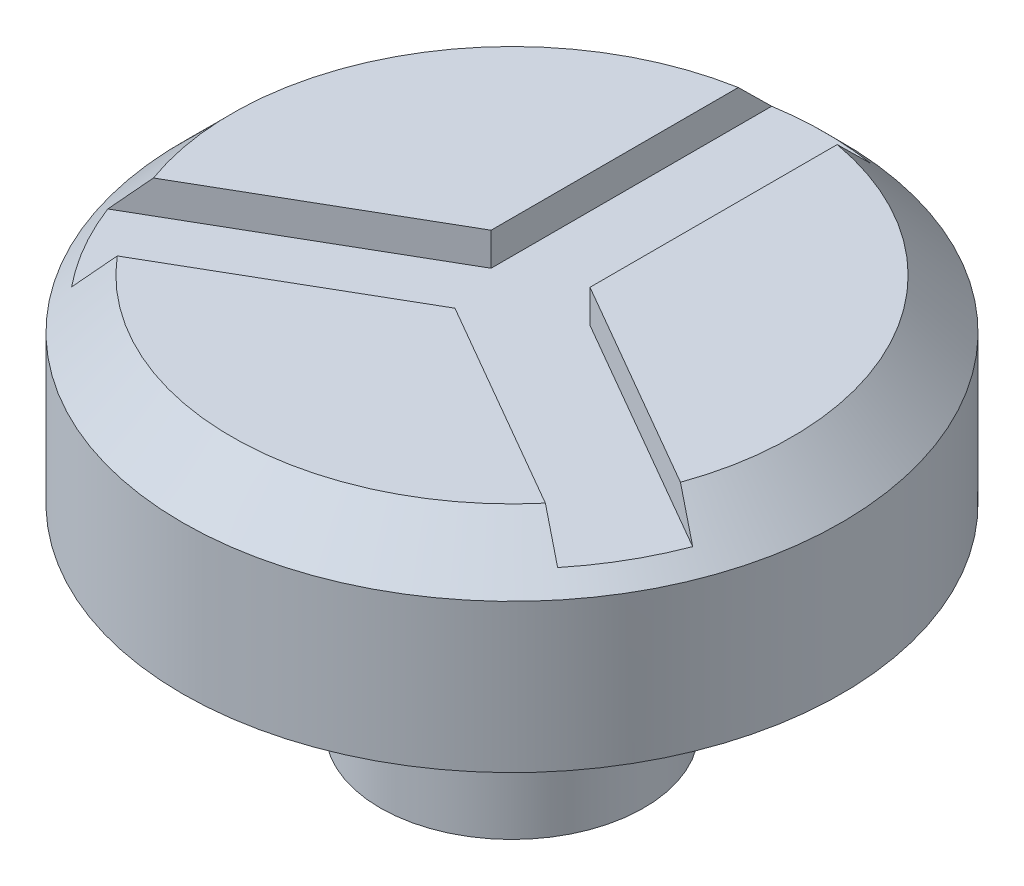
ISO-10303-21;
HEADER;
FILE_DESCRIPTION(('STEP AP214'),'2;1');
FILE_NAME('part.step','',(''),(''),'','','');
FILE_SCHEMA(('AUTOMOTIVE_DESIGN { 1 0 10303 214 1 1 1 1 }'));
ENDSEC;
DATA;
#1=APPLICATION_CONTEXT('core data for automotive mechanical design processes');
#2=APPLICATION_PROTOCOL_DEFINITION('international standard','automotive_design',2000,#1);
#3=PRODUCT_CONTEXT('',#1,'mechanical');
#4=PRODUCT('Part','Part','',(#3));
#5=PRODUCT_RELATED_PRODUCT_CATEGORY('part','',(#4));
#6=PRODUCT_DEFINITION_FORMATION('','',#4);
#7=PRODUCT_DEFINITION_CONTEXT('part definition',#1,'design');
#8=PRODUCT_DEFINITION('design','',#6,#7);
#9=PRODUCT_DEFINITION_SHAPE('','',#8);
#10=(LENGTH_UNIT() NAMED_UNIT(*) SI_UNIT(.MILLI.,.METRE.));
#11=(NAMED_UNIT(*) PLANE_ANGLE_UNIT() SI_UNIT($,.RADIAN.));
#12=(NAMED_UNIT(*) SI_UNIT($,.STERADIAN.) SOLID_ANGLE_UNIT());
#13=UNCERTAINTY_MEASURE_WITH_UNIT(LENGTH_MEASURE(1.E-05),#10,'distance_accuracy_value','');
#14=(GEOMETRIC_REPRESENTATION_CONTEXT(3) GLOBAL_UNCERTAINTY_ASSIGNED_CONTEXT((#13)) GLOBAL_UNIT_ASSIGNED_CONTEXT((#10,
#11,#12)) REPRESENTATION_CONTEXT('',''));
#15=CARTESIAN_POINT('',(0.,0.,0.));
#16=DIRECTION('',(0.,0.,1.));
#17=DIRECTION('',(1.,0.,0.));
#18=AXIS2_PLACEMENT_3D('',#15,#16,#17);
#19=CARTESIAN_POINT('',(0.,60.,0.));
#20=DIRECTION('',(0.,1.,0.));
#21=DIRECTION('',(0.,0.,1.));
#22=AXIS2_PLACEMENT_3D('',#19,#20,#21);
#23=PLANE('',#22);
#24=DIRECTION('',(0.866025403784439,0.,0.5));
#25=VECTOR('',#24,1.);
#26=CARTESIAN_POINT('',(39.5512701892219,60.,31.4951905283833));
#27=LINE('',#26,#25);
#28=CARTESIAN_POINT('',(0.,60.,8.66025403784439));
#29=VERTEX_POINT('',#28);
#30=CARTESIAN_POINT('',(32.4784418654736,60.,27.4116911917352));
#31=VERTEX_POINT('',#30);
#32=EDGE_CURVE('E117',#29,#31,#27,.T.);
#33=ORIENTED_EDGE('',*,*,#32,.F.);
#34=DIRECTION('',(0.866025403784439,0.,-0.5));
#35=VECTOR('',#34,1.);
#36=CARTESIAN_POINT('',(0.,60.,8.66025403784439));
#37=LINE('',#36,#35);
#38=CARTESIAN_POINT('',(-32.4784418654736,60.,27.4116911917352));
#39=VERTEX_POINT('',#38);
#40=EDGE_CURVE('E150',#39,#29,#37,.T.);
#41=ORIENTED_EDGE('',*,*,#40,.F.);
#42=CARTESIAN_POINT('',(0.,60.,0.));
#43=DIRECTION('',(0.,1.,0.));
#44=DIRECTION('',(0.,0.,1.));
#45=AXIS2_PLACEMENT_3D('',#42,#43,#44);
#46=CIRCLE('',#45,42.5);
#47=EDGE_CURVE('E165',#39,#31,#46,.T.);
#48=ORIENTED_EDGE('',*,*,#47,.T.);
#49=EDGE_LOOP('',(#33,#41,#48));
#50=FACE_BOUND('',#49,.T.);
#51=ADVANCED_FACE('F38',(#50),#23,.T.);
#52=DIRECTION('',(-0.866025403784438,0.,0.5));
#53=VECTOR('',#52,1.);
#54=CARTESIAN_POINT('',(-7.5,60.,-4.33012701892219));
#55=LINE('',#54,#53);
#56=CARTESIAN_POINT('',(-7.5,60.,-4.33012701892219));
#57=VERTEX_POINT('',#56);
#58=CARTESIAN_POINT('',(-39.9784418654736,60.,14.4213101349686));
#59=VERTEX_POINT('',#58);
#60=EDGE_CURVE('E148',#57,#59,#55,.T.);
#61=ORIENTED_EDGE('',*,*,#60,.F.);
#62=DIRECTION('',(0.,0.,1.));
#63=VECTOR('',#62,1.);
#64=CARTESIAN_POINT('',(-7.5,60.,-4.33012701892219));
#65=LINE('',#64,#63);
#66=CARTESIAN_POINT('',(-7.5,60.,-41.8330013267038));
#67=VERTEX_POINT('',#66);
#68=EDGE_CURVE('E146',#67,#57,#65,.T.);
#69=ORIENTED_EDGE('',*,*,#68,.F.);
#70=EDGE_CURVE('E170',#67,#59,#46,.T.);
#71=ORIENTED_EDGE('',*,*,#70,.T.);
#72=EDGE_LOOP('',(#61,#69,#71));
#73=FACE_BOUND('',#72,.T.);
#74=ADVANCED_FACE('F236',(#73),#23,.T.);
#75=CARTESIAN_POINT('',(0.,30.,0.));
#76=DIRECTION('',(0.,-1.,0.));
#77=DIRECTION('',(0.,0.,-1.));
#78=AXIS2_PLACEMENT_3D('',#75,#76,#77);
#79=CYLINDRICAL_SURFACE('',#78,20.);
#80=CARTESIAN_POINT('',(0.,30.,0.));
#81=DIRECTION('',(0.,1.,0.));
#82=DIRECTION('',(0.,0.,1.));
#83=AXIS2_PLACEMENT_3D('',#80,#81,#82);
#84=CIRCLE('',#83,20.);
#85=CARTESIAN_POINT('',(0.,30.,20.));
#86=VERTEX_POINT('',#85);
#87=EDGE_CURVE('E162',#86,#86,#84,.T.);
#88=ORIENTED_EDGE('',*,*,#87,.F.);
#89=EDGE_LOOP('',(#88));
#90=FACE_BOUND('',#89,.T.);
#91=CARTESIAN_POINT('',(0.,0.,0.));
#92=DIRECTION('',(0.,1.,0.));
#93=DIRECTION('',(0.,0.,1.));
#94=AXIS2_PLACEMENT_3D('',#91,#92,#93);
#95=CIRCLE('',#94,20.);
#96=CARTESIAN_POINT('',(0.,0.,20.));
#97=VERTEX_POINT('',#96);
#98=EDGE_CURVE('E161',#97,#97,#95,.T.);
#99=ORIENTED_EDGE('',*,*,#98,.T.);
#100=EDGE_LOOP('',(#99));
#101=FACE_BOUND('',#100,.T.);
#102=ADVANCED_FACE('F241',(#90,#101),#79,.T.);
#103=CARTESIAN_POINT('',(0.,0.,0.));
#104=DIRECTION('',(0.,1.,0.));
#105=DIRECTION('',(0.,0.,1.));
#106=AXIS2_PLACEMENT_3D('',#103,#104,#105);
#107=PLANE('',#106);
#108=ORIENTED_EDGE('',*,*,#98,.F.);
#109=EDGE_LOOP('',(#108));
#110=FACE_BOUND('',#109,.T.);
#111=ADVANCED_FACE('F253',(#110),#107,.F.);
#112=CARTESIAN_POINT('',(0.,60.,0.));
#113=DIRECTION('',(0.,-1.,0.));
#114=DIRECTION('',(0.,0.,-1.));
#115=AXIS2_PLACEMENT_3D('',#112,#113,#114);
#116=CYLINDRICAL_SURFACE('',#115,50.);
#117=CARTESIAN_POINT('',(0.,52.5,0.));
#118=DIRECTION('',(0.,1.,0.));
#119=DIRECTION('',(0.,0.,1.));
#120=AXIS2_PLACEMENT_3D('',#117,#118,#119);
#121=CIRCLE('',#120,50.);
#122=CARTESIAN_POINT('',(0.,52.5,50.));
#123=VERTEX_POINT('',#122);
#124=EDGE_CURVE('E172',#123,#123,#121,.F.);
#125=ORIENTED_EDGE('',*,*,#124,.T.);
#126=EDGE_LOOP('',(#125));
#127=FACE_BOUND('',#126,.T.);
#128=CARTESIAN_POINT('',(0.,30.,0.));
#129=DIRECTION('',(0.,1.,0.));
#130=DIRECTION('',(0.,0.,1.));
#131=AXIS2_PLACEMENT_3D('',#128,#129,#130);
#132=CIRCLE('',#131,50.);
#133=CARTESIAN_POINT('',(0.,30.,50.));
#134=VERTEX_POINT('',#133);
#135=EDGE_CURVE('E156',#134,#134,#132,.T.);
#136=ORIENTED_EDGE('',*,*,#135,.T.);
#137=EDGE_LOOP('',(#136));
#138=FACE_BOUND('',#137,.T.);
#139=ADVANCED_FACE('F246',(#127,#138),#116,.T.);
#140=DIRECTION('',(0.,0.,-1.));
#141=VECTOR('',#140,1.);
#142=CARTESIAN_POINT('',(7.5,60.,-4.33012701892221));
#143=LINE('',#142,#141);
#144=CARTESIAN_POINT('',(7.5,60.,-4.33012701892221));
#145=VERTEX_POINT('',#144);
#146=CARTESIAN_POINT('',(7.5,60.,-41.8330013267038));
#147=VERTEX_POINT('',#146);
#148=EDGE_CURVE('E144',#145,#147,#143,.T.);
#149=ORIENTED_EDGE('',*,*,#148,.F.);
#150=DIRECTION('',(-0.866025403784438,0.,-0.5));
#151=VECTOR('',#150,1.);
#152=CARTESIAN_POINT('',(47.0512701892219,60.,18.5048094716167));
#153=LINE('',#152,#151);
#154=CARTESIAN_POINT('',(39.9784418654736,60.,14.4213101349686));
#155=VERTEX_POINT('',#154);
#156=EDGE_CURVE('E123',#155,#145,#153,.T.);
#157=ORIENTED_EDGE('',*,*,#156,.F.);
#158=EDGE_CURVE('E171',#155,#147,#46,.T.);
#159=ORIENTED_EDGE('',*,*,#158,.T.);
#160=EDGE_LOOP('',(#149,#157,#159));
#161=FACE_BOUND('',#160,.T.);
#162=ADVANCED_FACE('F200',(#161),#23,.T.);
#163=CARTESIAN_POINT('',(0.,30.,0.));
#164=DIRECTION('',(0.,1.,0.));
#165=DIRECTION('',(0.,0.,1.));
#166=AXIS2_PLACEMENT_3D('',#163,#164,#165);
#167=PLANE('',#166);
#168=ORIENTED_EDGE('',*,*,#87,.T.);
#169=EDGE_LOOP('',(#168));
#170=FACE_BOUND('',#169,.T.);
#171=ORIENTED_EDGE('',*,*,#135,.F.);
#172=EDGE_LOOP('',(#171));
#173=FACE_BOUND('',#172,.T.);
#174=ADVANCED_FACE('F245',(#170,#173),#167,.F.);
#175=CARTESIAN_POINT('',(0.,60.,0.));
#176=DIRECTION('',(0.,-1.,0.));
#177=DIRECTION('',(0.,0.,-1.));
#178=AXIS2_PLACEMENT_3D('',#175,#176,#177);
#179=CONICAL_SURFACE('',#178,42.5,0.785398163397446);
#180=CARTESIAN_POINT('',(-36.870367428545,54.9998,29.9473705978353));
#181=CARTESIAN_POINT('',(-36.5046308322191,55.4168182899522,29.736212475494));
#182=CARTESIAN_POINT('',(-36.138833818509,55.833765938987,29.5250194711597));
#183=CARTESIAN_POINT('',(-35.4071079359677,56.6675068059703,29.1025573359015));
#184=CARTESIAN_POINT('',(-35.0411790671576,57.0843000239431,28.8912882049897));
#185=CARTESIAN_POINT('',(-34.3091783291183,57.9177190220173,28.4686673818357));
#186=CARTESIAN_POINT('',(-33.9431064598858,58.3343448021145,28.2573156895916));
#187=CARTESIAN_POINT('',(-33.2108065619172,59.1674134672323,27.8345221463719));
#188=CARTESIAN_POINT('',(-32.8445785331564,59.5838563522238,27.6230802953821));
#189=CARTESIAN_POINT('',(-32.4782658987427,60.0002,27.4115895972957));
#190=B_SPLINE_CURVE_WITH_KNOTS('',3,(#180,#181,#182,#183,#184,#185,#186,#187,#188,#189),
.UNSPECIFIED.,.F.,.F.,(4,2,2,2,4),(0.,1.78053289386737,3.56106550523206,5.34159815987409,
7.12213109711299),.UNSPECIFIED.);
#191=CARTESIAN_POINT('',(-36.8701920231798,55.,29.9472693275005));
#192=VERTEX_POINT('',#191);
#193=EDGE_CURVE('E11',#192,#39,#190,.T.);
#194=ORIENTED_EDGE('',*,*,#193,.F.);
#195=CARTESIAN_POINT('',(0.,55.,0.));
#196=DIRECTION('',(0.,-1.,0.));
#197=DIRECTION('',(0.,0.,-1.));
#198=AXIS2_PLACEMENT_3D('',#195,#196,#197);
#199=CIRCLE('',#198,47.5);
#200=CARTESIAN_POINT('',(-44.3701920231798,55.,16.9568882707339));
#201=VERTEX_POINT('',#200);
#202=EDGE_CURVE('E177',#201,#192,#199,.F.);
#203=ORIENTED_EDGE('',*,*,#202,.F.);
#204=CARTESIAN_POINT('',(-39.9782658987427,60.0002,14.4212085405291));
#205=CARTESIAN_POINT('',(-40.3445785331564,59.5838563522238,14.6326992386155));
#206=CARTESIAN_POINT('',(-40.7108065619172,59.1674134672323,14.8441410896053));
#207=CARTESIAN_POINT('',(-41.4431064598858,58.3343448021145,15.266934632825));
#208=CARTESIAN_POINT('',(-41.8091783291183,57.9177190220173,15.4782863250691));
#209=CARTESIAN_POINT('',(-42.5411790671576,57.0843000239431,15.9009071482231));
#210=CARTESIAN_POINT('',(-42.9071079359677,56.6675068059703,16.1121762791349));
#211=CARTESIAN_POINT('',(-43.638833818509,55.8337659389871,16.5346384143931));
#212=CARTESIAN_POINT('',(-44.0046308322191,55.4168182899522,16.7458314187275));
#213=CARTESIAN_POINT('',(-44.370367428545,54.9998,16.9569895410687));
#214=B_SPLINE_CURVE_WITH_KNOTS('',3,(#204,#205,#206,#207,#208,#209,#210,#211,#212,#213),
.UNSPECIFIED.,.F.,.F.,(4,2,2,2,4),(0.,1.7805329372389,3.56106559188092,5.3415982032456,
7.12213109711298),.UNSPECIFIED.);
#215=EDGE_CURVE('E53',#59,#201,#214,.T.);
#216=ORIENTED_EDGE('',*,*,#215,.F.);
#217=ORIENTED_EDGE('',*,*,#70,.F.);
#218=CARTESIAN_POINT('',(-7.5,9.05703889329484,-93.1414890389303));
#219=CARTESIAN_POINT('',(-7.5,10.7090878400604,-91.484089807516));
#220=CARTESIAN_POINT('',(-7.5,12.360997561704,-89.8265517883662));
#221=CARTESIAN_POINT('',(-7.5,15.6644802884674,-86.5111398437975));
#222=CARTESIAN_POINT('',(-7.5,17.3160532935459,-84.8532659183374));
#223=CARTESIAN_POINT('',(-7.5,22.2703314132519,-79.8789005925198));
#224=CARTESIAN_POINT('',(-7.5,25.5724433727972,-76.5618183738528));
#225=CARTESIAN_POINT('',(-7.5,32.1780543710886,-69.9216821214136));
#226=CARTESIAN_POINT('',(-7.5,35.4815508604259,-66.5986255507435));
#227=CARTESIAN_POINT('',(-7.5,40.4340411254297,-61.6114515807588));
#228=CARTESIAN_POINT('',(-7.5,42.0843755934234,-59.9486656157465));
#229=CARTESIAN_POINT('',(-7.5,45.3838895063785,-56.6219512164983));
#230=CARTESIAN_POINT('',(-7.5,47.0330689524824,-54.9580227833955));
#231=CARTESIAN_POINT('',(-7.5,50.2442892433119,-51.7151589625117));
#232=CARTESIAN_POINT('',(-7.5,51.8064060881726,-50.1362988426088));
#233=CARTESIAN_POINT('',(-7.5,54.9288662715011,-46.9768140630575));
#234=CARTESIAN_POINT('',(-7.5,56.489209603496,-45.3961893970106));
#235=CARTESIAN_POINT('',(-7.5,59.607692289525,-42.2323496358492));
#236=CARTESIAN_POINT('',(-7.5,61.1658313204809,-40.649134222224));
#237=CARTESIAN_POINT('',(-7.5,64.2787190225544,-37.4794109460616));
#238=CARTESIAN_POINT('',(-7.5,65.8334677367243,-35.8929031258385));
#239=CARTESIAN_POINT('',(-7.5,68.1613399898357,-33.5100281442165));
#240=CARTESIAN_POINT('',(-7.5,68.9363299059803,-32.7154844263305));
#241=CARTESIAN_POINT('',(-7.5,70.4847610585097,-31.1248892433756));
#242=CARTESIAN_POINT('',(-7.5,71.2582022952609,-30.3288377786634));
#243=CARTESIAN_POINT('',(-7.5,72.8031835829414,-28.7348117120257));
#244=CARTESIAN_POINT('',(-7.5,73.5747235336498,-27.9368370129297));
#245=CARTESIAN_POINT('',(-7.5,75.115316953015,-26.3384938510399));
#246=CARTESIAN_POINT('',(-7.5,75.8843704286595,-25.5381253949854));
#247=CARTESIAN_POINT('',(-7.5,77.4190473704026,-23.93445904577));
#248=CARTESIAN_POINT('',(-7.5,78.1846715872045,-23.131161871383));
#249=CARTESIAN_POINT('',(-7.5,79.7115597982406,-21.5204340429372));
#250=CARTESIAN_POINT('',(-7.5,80.4728238122444,-20.7130034076513));
#251=CARTESIAN_POINT('',(-7.5,81.6101259458165,-19.4976168906666));
#252=CARTESIAN_POINT('',(-7.5,81.9884466006674,-19.0917969223772));
#253=CARTESIAN_POINT('',(-7.5,82.7432550484622,-18.2784566501443));
#254=CARTESIAN_POINT('',(-7.5,83.1197428458497,-17.8709363503274));
#255=CARTESIAN_POINT('',(-7.5,83.8704947798185,-17.0538691008906));
#256=CARTESIAN_POINT('',(-7.5,84.244758967678,-16.644322198408));
#257=CARTESIAN_POINT('',(-7.5,84.9905705279583,-15.8227635390833));
#258=CARTESIAN_POINT('',(-7.5,85.362117919899,-15.4107517999896));
#259=CARTESIAN_POINT('',(-7.5,85.8349979416402,-14.8820338839079));
#260=CARTESIAN_POINT('',(-7.5,85.9378932468824,-14.7667241934549));
#261=CARTESIAN_POINT('',(-7.5,86.1434026361248,-14.535853862792));
#262=CARTESIAN_POINT('',(-7.5,86.2460167193276,-14.4202932218722));
#263=CARTESIAN_POINT('',(-7.5,86.5534103241688,-14.0732111065303));
#264=CARTESIAN_POINT('',(-7.5,86.7577399377314,-13.8412908511239));
#265=CARTESIAN_POINT('',(-7.5,87.1650478364739,-13.3762240929386));
#266=CARTESIAN_POINT('',(-7.5,87.3680259830388,-13.1430774686351));
#267=CARTESIAN_POINT('',(-7.5,87.7723946818131,-12.6754135421518));
#268=CARTESIAN_POINT('',(-7.5,87.9737852347585,-12.4408962406073));
#269=CARTESIAN_POINT('',(-7.5,88.5787195061488,-11.7309070599293));
#270=CARTESIAN_POINT('',(-7.5,88.9794720269339,-11.2530396739754));
#271=CARTESIAN_POINT('',(-7.5,89.5728391008482,-10.5299710781164));
#272=CARTESIAN_POINT('',(-7.5,89.7693112337815,-10.2879332541349));
#273=CARTESIAN_POINT('',(-7.5,90.1591729205265,-9.80138994998288));
#274=CARTESIAN_POINT('',(-7.5,90.3525625288453,-9.55688451357122));
#275=CARTESIAN_POINT('',(-7.5,90.7374307376372,-9.06268648223334));
#276=CARTESIAN_POINT('',(-7.5,90.9288745719554,-8.81296676358345));
#277=CARTESIAN_POINT('',(-7.5,91.3071658307577,-8.31005448116425));
#278=CARTESIAN_POINT('',(-7.5,91.4940131736948,-8.05686185590558));
#279=CARTESIAN_POINT('',(-7.5,91.8622807915208,-7.54602284894775));
#280=CARTESIAN_POINT('',(-7.5,92.0436933240046,-7.28837086829813));
#281=CARTESIAN_POINT('',(-7.5,92.3993900417653,-6.76818708544368));
#282=CARTESIAN_POINT('',(-7.5,92.5736745080766,-6.50565547622));
#283=CARTESIAN_POINT('',(-7.5,92.9117853163963,-5.97702376015611));
#284=CARTESIAN_POINT('',(-7.5,93.0756873934159,-5.71097234845842));
#285=CARTESIAN_POINT('',(-7.5,93.3921549454061,-5.17208179997301));
#286=CARTESIAN_POINT('',(-7.5,93.5447179575317,-4.89924120565222));
#287=CARTESIAN_POINT('',(-7.5,93.8347574403491,-4.34645441633658));
#288=CARTESIAN_POINT('',(-7.5,93.9722705244057,-4.06652760225322));
#289=CARTESIAN_POINT('',(-7.5,94.2281942974371,-3.49815231807943));
#290=CARTESIAN_POINT('',(-7.5,94.3466176808312,-3.20970966319347));
#291=CARTESIAN_POINT('',(-7.5,94.5336425804601,-2.69370248226024));
#292=CARTESIAN_POINT('',(-7.5,94.607391421533,-2.4680142809041));
#293=CARTESIAN_POINT('',(-7.5,94.7379614360794,-2.01171530556356));
#294=CARTESIAN_POINT('',(-7.5,94.7947820735978,-1.78110437597087));
#295=CARTESIAN_POINT('',(-7.5,94.8886767135323,-1.31670707162866));
#296=CARTESIAN_POINT('',(-7.5,94.9258214266588,-1.08293520711588));
#297=CARTESIAN_POINT('',(-7.5,94.9786145719957,-0.612957633748463));
#298=CARTESIAN_POINT('',(-7.5,94.9942651059025,-0.376752165126954));
#299=CARTESIAN_POINT('',(-7.5,95.0031323261497,0.0973148691342635));
#300=CARTESIAN_POINT('',(-7.5,94.996232171712,0.3351786679019));
#301=CARTESIAN_POINT('',(-7.5,94.9601779980952,0.809196700612902));
#302=CARTESIAN_POINT('',(-7.5,94.9310226350808,1.0453508304521));
#303=CARTESIAN_POINT('',(-7.5,94.8520546753208,1.51487122014354));
#304=CARTESIAN_POINT('',(-7.5,94.8021787097267,1.74822664872194));
#305=CARTESIAN_POINT('',(-7.5,94.6842887778491,2.21026940814599));
#306=CARTESIAN_POINT('',(-7.5,94.616272815924,2.43895622240001));
#307=CARTESIAN_POINT('',(-7.5,94.4622266914439,2.89904300636613));
#308=CARTESIAN_POINT('',(-7.5,94.3756493004311,3.13025774401728));
#309=CARTESIAN_POINT('',(-7.5,94.188914092908,3.58715071950333));
#310=CARTESIAN_POINT('',(-7.5,94.0887526347316,3.81282745346526));
#311=CARTESIAN_POINT('',(-7.5,93.8772108020739,4.2592479762557));
#312=CARTESIAN_POINT('',(-7.5,93.7658132725064,4.47998357352414));
#313=CARTESIAN_POINT('',(-7.5,93.5340156520235,4.91661453978911));
#314=CARTESIAN_POINT('',(-7.5,93.4136165712933,5.13251044838813));
#315=CARTESIAN_POINT('',(-7.5,93.1644998529775,5.56168406370459));
#316=CARTESIAN_POINT('',(-7.5,93.0357246231391,5.77492818304063));
#317=CARTESIAN_POINT('',(-7.5,92.7720572064322,6.1975919487337));
#318=CARTESIAN_POINT('',(-7.5,92.6371648907728,6.4070115144371));
#319=CARTESIAN_POINT('',(-7.5,92.3624606943627,6.82231109726643));
#320=CARTESIAN_POINT('',(-7.5,92.22265346641,7.02819420122857));
#321=CARTESIAN_POINT('',(-7.5,91.9388516339457,7.43703547909));
#322=CARTESIAN_POINT('',(-7.5,91.7948571803927,7.63999375804201));
#323=CARTESIAN_POINT('',(-7.5,91.4901949029783,8.06157060419899));
#324=CARTESIAN_POINT('',(-7.5,91.3291953103897,8.27994904641512));
#325=CARTESIAN_POINT('',(-7.5,91.0037047111592,8.71409171589388));
#326=CARTESIAN_POINT('',(-7.5,90.8392136034221,8.92985586717598));
#327=CARTESIAN_POINT('',(-7.5,90.3413220103131,9.57381147898465));
#328=CARTESIAN_POINT('',(-7.5,90.0035399369785,9.99861588927034));
#329=CARTESIAN_POINT('',(-7.5,89.3193675919917,10.841563513772));
#330=CARTESIAN_POINT('',(-7.5,88.9729728875094,11.259703108066));
#331=CARTESIAN_POINT('',(-7.5,88.273873346752,12.0906190299451));
#332=CARTESIAN_POINT('',(-7.5,87.9211689028694,12.5033956883055));
#333=CARTESIAN_POINT('',(-7.5,87.2102790413543,13.3254719186727));
#334=CARTESIAN_POINT('',(-7.5,86.8520850193451,13.7347640336635));
#335=CARTESIAN_POINT('',(-7.5,86.131877163166,14.5499788064445));
#336=CARTESIAN_POINT('',(-7.5,85.7698632781008,14.955901419211));
#337=CARTESIAN_POINT('',(-7.5,85.0429032560785,15.7648884821464));
#338=CARTESIAN_POINT('',(-7.5,84.677958035504,16.167953756655));
#339=CARTESIAN_POINT('',(-7.5,83.9455982387959,16.9718358945889));
#340=CARTESIAN_POINT('',(-7.5,83.5781836515706,17.3726527479));
#341=CARTESIAN_POINT('',(-7.5,82.4752551342874,18.5697872827271));
#342=CARTESIAN_POINT('',(-7.5,81.7367473894974,19.363346337507));
#343=CARTESIAN_POINT('',(-7.5,80.2541118098814,20.9452903594623));
#344=CARTESIAN_POINT('',(-7.5,79.5099835784055,21.7336749539865));
#345=CARTESIAN_POINT('',(-7.5,78.0183557981941,23.3058472730174));
#346=CARTESIAN_POINT('',(-7.5,77.2708600472197,24.0896386031214));
#347=CARTESIAN_POINT('',(-7.5,75.7728171200119,25.6543005483303));
#348=CARTESIAN_POINT('',(-7.5,75.0222699371124,26.4351711570476));
#349=CARTESIAN_POINT('',(-7.5,73.1070623719647,28.4217887645941));
#350=CARTESIAN_POINT('',(-7.5,71.9407713546204,29.6259632732646));
#351=CARTESIAN_POINT('',(-7.5,69.6040000625976,32.0308776629351));
#352=CARTESIAN_POINT('',(-7.5,68.4335187283955,33.2316165133332));
#353=CARTESIAN_POINT('',(-7.5,66.0896641514436,35.6304321882914));
#354=CARTESIAN_POINT('',(-7.5,64.9162907116095,36.8285088202256));
#355=CARTESIAN_POINT('',(-7.5,63.1548213778313,38.6239094546137));
#356=CARTESIAN_POINT('',(-7.5,62.5675129253057,39.2220064591844));
#357=CARTESIAN_POINT('',(-7.5,61.3924342912162,40.4177458957106));
#358=CARTESIAN_POINT('',(-7.5,60.8046641099817,41.0153883279896));
#359=CARTESIAN_POINT('',(-7.5,60.2166940647098,41.612834087783));
#360=B_SPLINE_CURVE_WITH_KNOTS('',3,(#218,#219,#220,#221,#222,#223,#224,#225,#226,#227,#228,
#229,#230,#231,#232,#233,#234,#235,#236,#237,#238,#239,#240,#241,#242,#243,#244,#245,#246,#247,
#248,#249,#250,#251,#252,#253,#254,#255,#256,#257,#258,#259,#260,#261,#262,#263,#264,#265,#266,
#267,#268,#269,#270,#271,#272,#273,#274,#275,#276,#277,#278,#279,#280,#281,#282,#283,#284,#285,
#286,#287,#288,#289,#290,#291,#292,#293,#294,#295,#296,#297,#298,#299,#300,#301,#302,#303,#304,
#305,#306,#307,#308,#309,#310,#311,#312,#313,#314,#315,#316,#317,#318,#319,#320,#321,#322,#323,
#324,#325,#326,#327,#328,#329,#330,#331,#332,#333,#334,#335,#336,#337,#338,#339,#340,#341,#342,
#343,#344,#345,#346,#347,#348,#349,#350,#351,#352,#353,#354,#355,#356,#357,#358,#359),
.UNSPECIFIED.,.F.,.F.,(4,2,2,2,2,2,2,2,2,2,2,2,2,2,2,2,2,2,2,2,2,2,2,2,2,2,2,2,2,2,2,2,2,2,2,2,
2,2,2,2,2,2,2,2,2,2,2,2,2,2,2,2,2,2,2,2,2,2,2,2,2,2,2,2,2,2,2,2,2,2,4),(0.,7.02040892053811,
14.040818702249,28.0822852493172,42.1393862430573,49.167625244375,56.195857284878,
62.85896928291,69.5221055220285,76.1861339292965,82.850077214308,86.1798176323004,
89.5095572625578,92.8394688087612,96.1693709888702,99.4985046021966,102.827623109007,
104.492054812404,106.156482478726,107.820871612033,109.485248775079,109.948879659084,
110.412511856311,111.339781933743,112.267145696358,113.194509029081,115.065380351727,
116.00059001042,116.935783113765,117.879718856154,118.823671332974,119.768910129552,
120.714111622726,121.651350279118,122.588791912436,123.5238997229,124.45838310965,
125.170132490005,125.881904402296,126.591100712902,127.300227673502,128.013034612159,
128.725884595615,129.440930893212,130.156055887912,130.896213008812,131.63656894741,
132.37807287235,133.119493707704,133.866701377667,134.613924786876,135.36045892514,
136.106966182516,136.920858464772,137.734774345145,139.362792577141,140.991666825977,
142.620440127505,144.252099452672,145.883780545271,147.514969996377,149.146166779291,
152.398224141933,155.650513194531,158.899764741621,162.149023390588,167.178168167818,
172.208689836619,177.239564353767,179.754293032304,182.269019919064),.UNSPECIFIED.);
#361=CARTESIAN_POINT('',(-7.5,55.,-46.9041575982343));
#362=VERTEX_POINT('',#361);
#363=EDGE_CURVE('E184',#362,#67,#360,.T.);
#364=ORIENTED_EDGE('',*,*,#363,.F.);
#365=CARTESIAN_POINT('',(7.5,55.,-46.9041575982343));
#366=VERTEX_POINT('',#365);
#367=EDGE_CURVE('E175',#366,#362,#199,.F.);
#368=ORIENTED_EDGE('',*,*,#367,.F.);
#369=CARTESIAN_POINT('',(7.5,60.2166940647098,41.6128340877829));
#370=CARTESIAN_POINT('',(7.5,61.3202289826668,40.4914626476753));
#371=CARTESIAN_POINT('',(7.5,62.4231054913646,39.3694418316446));
#372=CARTESIAN_POINT('',(7.5,64.6281874956441,37.1223938606089));
#373=CARTESIAN_POINT('',(7.5,65.7303910249194,35.9973647763203));
#374=CARTESIAN_POINT('',(7.5,67.9531629199132,33.723761835256));
#375=CARTESIAN_POINT('',(7.5,69.0736860509752,32.5751437238751));
#376=CARTESIAN_POINT('',(7.5,70.7513490828612,30.8503568612848));
#377=CARTESIAN_POINT('',(7.5,71.3097566464947,30.2754211376345));
#378=CARTESIAN_POINT('',(7.5,72.4255569481184,29.1245940168272));
#379=CARTESIAN_POINT('',(7.5,72.9829497115447,28.5487026443349));
#380=CARTESIAN_POINT('',(7.5,74.4314457804574,27.0490495877649));
#381=CARTESIAN_POINT('',(7.5,75.3216212712169,26.1243911850925));
#382=CARTESIAN_POINT('',(7.5,77.0979791033843,24.2710294883035));
#383=CARTESIAN_POINT('',(7.5,77.984160955741,23.3423257247924));
#384=CARTESIAN_POINT('',(7.5,79.3108533219179,21.9432983310393));
#385=CARTESIAN_POINT('',(7.5,79.7535281484247,21.4750272409879));
#386=CARTESIAN_POINT('',(7.5,80.6371087890654,20.5368195744372));
#387=CARTESIAN_POINT('',(7.5,81.0780146060877,20.0668830006597));
#388=CARTESIAN_POINT('',(7.5,81.9574759619351,19.1252086999671));
#389=CARTESIAN_POINT('',(7.5,82.3960324652029,18.6534718742976));
#390=CARTESIAN_POINT('',(7.5,83.2704808194082,17.7075398991587));
#391=CARTESIAN_POINT('',(7.5,83.7063726917613,17.2333447695034));
#392=CARTESIAN_POINT('',(7.5,84.5677731647959,16.2896081413359));
#393=CARTESIAN_POINT('',(7.5,84.9933355507699,15.8201157826205));
#394=CARTESIAN_POINT('',(7.5,85.8403446233964,14.8773989448866));
#395=CARTESIAN_POINT('',(7.5,86.2617911736304,14.404174343097));
#396=CARTESIAN_POINT('',(7.5,87.1000473684991,13.4521222646779));
#397=CARTESIAN_POINT('',(7.5,87.5168473469034,12.9732862651094));
#398=CARTESIAN_POINT('',(7.5,88.3431920218447,12.0094538878227));
#399=CARTESIAN_POINT('',(7.5,88.7527374818088,11.5244581676552));
#400=CARTESIAN_POINT('',(7.5,89.3579874977108,10.7926341913849));
#401=CARTESIAN_POINT('',(7.5,89.5574671957157,10.5489278699499));
#402=CARTESIAN_POINT('',(7.5,89.953474657594,10.0591308742485));
#403=CARTESIAN_POINT('',(7.5,90.1500024675974,9.81304023734167));
#404=CARTESIAN_POINT('',(7.5,90.5396173041307,9.31794475705431));
#405=CARTESIAN_POINT('',(7.5,90.7327025473644,9.06893850799613));
#406=CARTESIAN_POINT('',(7.5,91.1145646199565,8.56764385995296));
#407=CARTESIAN_POINT('',(7.5,91.303341529165,8.31535552193399));
#408=CARTESIAN_POINT('',(7.5,91.6750261486833,7.80768049312949));
#409=CARTESIAN_POINT('',(7.5,91.8579502206827,7.55230581319847));
#410=CARTESIAN_POINT('',(7.5,92.2172701079506,7.03695065517956));
#411=CARTESIAN_POINT('',(7.5,92.3936653314173,6.77696976270849));
#412=CARTESIAN_POINT('',(7.5,92.7380353367701,6.25181829844186));
#413=CARTESIAN_POINT('',(7.5,92.9060178146006,5.9866527901745));
#414=CARTESIAN_POINT('',(7.5,93.2314301059831,5.44994945620298));
#415=CARTESIAN_POINT('',(7.5,93.3888627889461,5.17841339056019));
#416=CARTESIAN_POINT('',(7.5,93.5725967476185,4.84263166855545));
#417=CARTESIAN_POINT('',(7.5,93.6053908157369,4.78191651231214));
#418=CARTESIAN_POINT('',(7.5,93.6702811656464,4.66010677271602));
#419=CARTESIAN_POINT('',(7.5,93.7023773811288,4.59901215401031));
#420=CARTESIAN_POINT('',(7.5,93.7975661163665,4.41512841909678));
#421=CARTESIAN_POINT('',(7.5,93.8595470360312,4.29176072557005));
#422=CARTESIAN_POINT('',(7.5,93.980180522622,4.04340275580427));
#423=CARTESIAN_POINT('',(7.5,94.0388330178623,3.91841244468939));
#424=CARTESIAN_POINT('',(7.5,94.1524006302357,3.6667458454068));
#425=CARTESIAN_POINT('',(7.5,94.2073158573323,3.5400696069762));
#426=CARTESIAN_POINT('',(7.5,94.3123866327014,3.28636487345637));
#427=CARTESIAN_POINT('',(7.5,94.3625875144209,3.15935524864488));
#428=CARTESIAN_POINT('',(7.5,94.4584197862695,2.90363120730181));
#429=CARTESIAN_POINT('',(7.5,94.5040511497123,2.77491678081896));
#430=CARTESIAN_POINT('',(7.5,94.63334055293,2.38620759268617));
#431=CARTESIAN_POINT('',(7.5,94.709413485339,2.12360052883843));
#432=CARTESIAN_POINT('',(7.5,94.8250785397794,1.64260484189605));
#433=CARTESIAN_POINT('',(7.5,94.8688453856245,1.42522003946283));
#434=CARTESIAN_POINT('',(7.5,94.9383372938579,0.987599509214975));
#435=CARTESIAN_POINT('',(7.5,94.9640678567622,0.767364671460103));
#436=CARTESIAN_POINT('',(7.5,94.9961574679919,0.325714637411883));
#437=CARTESIAN_POINT('',(7.5,95.0025379094948,0.104301015973269));
#438=CARTESIAN_POINT('',(7.5,94.9956379698784,-0.338238929330965));
#439=CARTESIAN_POINT('',(7.5,94.9823555417034,-0.559365220884488));
#440=CARTESIAN_POINT('',(7.5,94.9369457391795,-0.998670245141997));
#441=CARTESIAN_POINT('',(7.5,94.9049006515519,-1.21685761869508));
#442=CARTESIAN_POINT('',(7.5,94.8235919902349,-1.65001123320929));
#443=CARTESIAN_POINT('',(7.5,94.7743241473488,-1.86497666171991));
#444=CARTESIAN_POINT('',(7.5,94.6604951015589,-2.29132604775903));
#445=CARTESIAN_POINT('',(7.5,94.5958974617625,-2.50270016646644));
#446=CARTESIAN_POINT('',(7.5,94.4536775212337,-2.92095710929444));
#447=CARTESIAN_POINT('',(7.5,94.3760558960399,-3.12784016573277));
#448=CARTESIAN_POINT('',(7.5,94.1711905355033,-3.63239158980473));
#449=CARTESIAN_POINT('',(7.5,94.0376649860865,-3.92750254232703));
#450=CARTESIAN_POINT('',(7.5,93.7526269252929,-4.50896902762197));
#451=CARTESIAN_POINT('',(7.5,93.6011039243954,-4.79531933092419));
#452=CARTESIAN_POINT('',(7.5,93.2840113570685,-5.36091267428773));
#453=CARTESIAN_POINT('',(7.5,93.1184112682306,-5.64013847120724));
#454=CARTESIAN_POINT('',(7.5,92.776666907232,-6.19193818242143));
#455=CARTESIAN_POINT('',(7.5,92.6005247122481,-6.46451339232076));
#456=CARTESIAN_POINT('',(7.5,92.2384301014856,-7.00648307116606));
#457=CARTESIAN_POINT('',(7.5,92.0524055980609,-7.27582915307815));
#458=CARTESIAN_POINT('',(7.5,91.6737384105168,-7.80982458654871));
#459=CARTESIAN_POINT('',(7.5,91.4810954846818,-8.07447376603223));
#460=CARTESIAN_POINT('',(7.5,91.0907894039649,-8.59946840511234));
#461=CARTESIAN_POINT('',(7.5,90.8931335352389,-8.85981929428955));
#462=CARTESIAN_POINT('',(7.5,90.5934439538047,-9.24785406871026));
#463=CARTESIAN_POINT('',(7.5,90.4930144559512,-9.37678207467989));
#464=CARTESIAN_POINT('',(7.5,90.2911834088726,-9.63387475380262));
#465=CARTESIAN_POINT('',(7.5,90.1897818613988,-9.76203942833017));
#466=CARTESIAN_POINT('',(7.5,89.8542125339515,-10.1831924853065));
#467=CARTESIAN_POINT('',(7.5,89.618168974167,-10.4746876233755));
#468=CARTESIAN_POINT('',(7.5,89.1423419182259,-11.054613076549));
#469=CARTESIAN_POINT('',(7.5,88.9025583282651,-11.3430433144762));
#470=CARTESIAN_POINT('',(7.5,88.4199067120421,-11.9173509523059));
#471=CARTESIAN_POINT('',(7.5,88.1770384246553,-12.2032281325521));
#472=CARTESIAN_POINT('',(7.5,87.6887547731115,-12.7728004948077));
#473=CARTESIAN_POINT('',(7.5,87.4433393857766,-13.0564956569204));
#474=CARTESIAN_POINT('',(7.5,86.7037599349311,-13.9049773809585));
#475=CARTESIAN_POINT('',(7.5,86.2064094545121,-14.4669864845776));
#476=CARTESIAN_POINT('',(7.5,85.205590166596,-15.5855303727394));
#477=CARTESIAN_POINT('',(7.5,84.7021212514015,-16.1420650606079));
#478=CARTESIAN_POINT('',(7.5,83.9431338527852,-16.9741018611682));
#479=CARTESIAN_POINT('',(7.5,83.6893334930706,-17.2511740718827));
#480=CARTESIAN_POINT('',(7.5,83.1807255442172,-17.8043875099819));
#481=CARTESIAN_POINT('',(7.5,82.9259179649207,-18.0805287464151));
#482=CARTESIAN_POINT('',(7.5,82.1601656047566,-18.9077354976268));
#483=CARTESIAN_POINT('',(7.5,81.647898011459,-19.4575766029174));
#484=CARTESIAN_POINT('',(7.5,80.6207124788964,-20.5545671717888));
#485=CARTESIAN_POINT('',(7.5,80.1057950931624,-21.1017171542751));
#486=CARTESIAN_POINT('',(7.5,79.0737565983723,-22.1939348582398));
#487=CARTESIAN_POINT('',(7.5,78.5566354869758,-22.7390025775055));
#488=CARTESIAN_POINT('',(7.5,77.0094101437784,-24.3645386039141));
#489=CARTESIAN_POINT('',(7.5,75.9766958408478,-25.4425221141762));
#490=CARTESIAN_POINT('',(7.5,73.9064514499027,-27.593950737489));
#491=CARTESIAN_POINT('',(7.5,72.8689211248763,-28.6673956221032));
#492=CARTESIAN_POINT('',(7.5,70.7911696355628,-30.8102007114659));
#493=CARTESIAN_POINT('',(7.5,69.7509509001534,-31.8795632723601));
#494=CARTESIAN_POINT('',(7.5,67.6679952577836,-34.0157995266236));
#495=CARTESIAN_POINT('',(7.5,66.6252583899682,-35.0826732581818));
#496=CARTESIAN_POINT('',(7.5,64.4164087747866,-37.3385641934274));
#497=CARTESIAN_POINT('',(7.5,63.2500584711633,-38.5273487360472));
#498=CARTESIAN_POINT('',(7.5,60.9155375601159,-40.9031294507196));
#499=CARTESIAN_POINT('',(7.5,59.747366952002,-42.090125622094));
#500=CARTESIAN_POINT('',(7.5,57.4096059198458,-44.4627334587032));
#501=CARTESIAN_POINT('',(7.5,56.240015486927,-45.6483451151902));
#502=CARTESIAN_POINT('',(7.5,53.8997144435846,-48.0184624404016));
#503=CARTESIAN_POINT('',(7.5,52.7290038330289,-49.2029681089957));
#504=CARTESIAN_POINT('',(7.5,49.2148409156316,-52.7558585958125));
#505=CARTESIAN_POINT('',(7.5,46.8700476701475,-55.1229170330317));
#506=CARTESIAN_POINT('',(7.5,42.1780650097651,-59.8546467483155));
#507=CARTESIAN_POINT('',(7.5,39.8308756000782,-62.2193180315498));
#508=CARTESIAN_POINT('',(7.5,35.1160831402023,-66.9657954495127));
#509=CARTESIAN_POINT('',(7.5,32.7484664300241,-69.3475880141396));
#510=CARTESIAN_POINT('',(7.5,28.011961307034,-74.1099116385323));
#511=CARTESIAN_POINT('',(7.5,25.6430728932942,-76.4904426973753));
#512=CARTESIAN_POINT('',(7.5,20.9050792269035,-81.2498124577699));
#513=CARTESIAN_POINT('',(7.5,18.5359742717591,-83.6286514555153));
#514=CARTESIAN_POINT('',(7.5,13.7970166715984,-88.385580561981));
#515=CARTESIAN_POINT('',(7.5,11.4271640272221,-90.7636706713389));
#516=CARTESIAN_POINT('',(7.5,9.05703889329486,-93.1414890389303));
#517=B_SPLINE_CURVE_WITH_KNOTS('',3,(#369,#370,#371,#372,#373,#374,#375,#376,#377,#378,#379,
#380,#381,#382,#383,#384,#385,#386,#387,#388,#389,#390,#391,#392,#393,#394,#395,#396,#397,#398,
#399,#400,#401,#402,#403,#404,#405,#406,#407,#408,#409,#410,#411,#412,#413,#414,#415,#416,#417,
#418,#419,#420,#421,#422,#423,#424,#425,#426,#427,#428,#429,#430,#431,#432,#433,#434,#435,#436,
#437,#438,#439,#440,#441,#442,#443,#444,#445,#446,#447,#448,#449,#450,#451,#452,#453,#454,#455,
#456,#457,#458,#459,#460,#461,#462,#463,#464,#465,#466,#467,#468,#469,#470,#471,#472,#473,#474,
#475,#476,#477,#478,#479,#480,#481,#482,#483,#484,#485,#486,#487,#488,#489,#490,#491,#492,#493,
#494,#495,#496,#497,#498,#499,#500,#501,#502,#503,#504,#505,#506,#507,#508,#509,#510,#511,#512,
#513,#514,#515,#516),.UNSPECIFIED.,.F.,.F.,(4,2,2,2,2,2,2,2,2,2,2,2,2,2,2,2,2,2,2,2,2,2,2,2,2,2,
2,2,2,2,2,2,2,2,2,2,2,2,2,2,2,2,2,2,2,2,2,2,2,2,2,2,2,2,2,2,2,2,2,2,2,2,2,2,2,2,2,2,2,2,2,2,2,
4),(0.,4.7198919581719,9.44481180016132,14.2587503316519,16.66318915625,19.0675668600844,
22.9180974425177,26.7690873924609,28.7022546497333,30.6354187492202,32.5677167816407,
34.4999992637373,36.4009641878192,38.3019919065988,40.2064273553737,42.1106611863236,
43.0554524328785,44.0002288994905,44.9454813309538,45.8907162290055,46.8330246562614,
47.7754182901048,48.7169334600494,49.6581915015564,49.8652052790157,50.0722386413605,
50.4863782409699,50.9005267567023,51.3146630814648,51.7242879442254,52.1339151991024,
52.9530190040794,53.6176025591379,54.2819833482064,54.9456293404847,55.6093444282673,
56.270170259715,56.9311600137276,57.5937368723815,58.2562793745897,59.2271601510066,
60.1986095920166,61.1722218835255,62.1456429656976,63.127543049715,64.1094790325128,
65.0900614699627,65.5803399487039,66.070617544386,67.1958180705763,68.3210468636016,
69.4463715524372,70.5717064904389,72.8230586911006,75.0744505778454,76.2016807316222,
77.3288998975678,79.5833685120918,81.8373838874039,84.0914016572115,88.569872665985,
93.048566462337,97.5240853751257,101.999535157113,106.995754626311,111.991975989545,
116.988228751426,121.984482102446,131.979937527589,141.975371259487,152.050433976232,
162.125504052759,172.197435133624,182.26935761689),.UNSPECIFIED.);
#518=EDGE_CURVE('E131',#147,#366,#517,.T.);
#519=ORIENTED_EDGE('',*,*,#518,.F.);
#520=ORIENTED_EDGE('',*,*,#158,.F.);
#521=CARTESIAN_POINT('',(44.370367428545,54.9998,16.9569895410687));
#522=CARTESIAN_POINT('',(44.0046308322192,55.4168182899522,16.7458314187274));
#523=CARTESIAN_POINT('',(43.638833818509,55.833765938987,16.5346384143931));
#524=CARTESIAN_POINT('',(42.9071079359677,56.6675068059703,16.1121762791349));
#525=CARTESIAN_POINT('',(42.5411790671576,57.0843000239431,15.9009071482231));
#526=CARTESIAN_POINT('',(41.8091783291183,57.9177190220173,15.4782863250691));
#527=CARTESIAN_POINT('',(41.4431064598858,58.3343448021145,15.266934632825));
#528=CARTESIAN_POINT('',(40.7108065619172,59.1674134672323,14.8441410896053));
#529=CARTESIAN_POINT('',(40.3445785331564,59.5838563522238,14.6326992386155));
#530=CARTESIAN_POINT('',(39.9782658987427,60.0002,14.4212085405291));
#531=B_SPLINE_CURVE_WITH_KNOTS('',3,(#521,#522,#523,#524,#525,#526,#527,#528,#529,#530),
.UNSPECIFIED.,.F.,.F.,(4,2,2,2,4),(0.,1.78053289386737,3.56106550523206,5.34159815987409,
7.12213109711299),.UNSPECIFIED.);
#532=CARTESIAN_POINT('',(44.3701920231798,55.,16.9568882707339));
#533=VERTEX_POINT('',#532);
#534=EDGE_CURVE('E202',#533,#155,#531,.T.);
#535=ORIENTED_EDGE('',*,*,#534,.F.);
#536=CARTESIAN_POINT('',(36.8701920231798,55.,29.9472693275005));
#537=VERTEX_POINT('',#536);
#538=EDGE_CURVE('E66',#537,#533,#199,.F.);
#539=ORIENTED_EDGE('',*,*,#538,.F.);
#540=CARTESIAN_POINT('',(32.4782658987427,60.0002,27.4115895972957));
#541=CARTESIAN_POINT('',(32.8445785331564,59.5838563522238,27.623080295382));
#542=CARTESIAN_POINT('',(33.2108065619172,59.1674134672323,27.8345221463719));
#543=CARTESIAN_POINT('',(33.9431064598858,58.3343448021145,28.2573156895916));
#544=CARTESIAN_POINT('',(34.3091783291183,57.9177190220173,28.4686673818357));
#545=CARTESIAN_POINT('',(35.0411790671576,57.0843000239431,28.8912882049897));
#546=CARTESIAN_POINT('',(35.4071079359677,56.6675068059703,29.1025573359015));
#547=CARTESIAN_POINT('',(36.138833818509,55.8337659389871,29.5250194711597));
#548=CARTESIAN_POINT('',(36.5046308322192,55.4168182899522,29.736212475494));
#549=CARTESIAN_POINT('',(36.870367428545,54.9998,29.9473705978353));
#550=B_SPLINE_CURVE_WITH_KNOTS('',3,(#540,#541,#542,#543,#544,#545,#546,#547,#548,#549),
.UNSPECIFIED.,.F.,.F.,(4,2,2,2,4),(0.,1.78053293723891,3.56106559188093,5.34159820324562,
7.122131097113),.UNSPECIFIED.);
#551=EDGE_CURVE('E208',#31,#537,#550,.T.);
#552=ORIENTED_EDGE('',*,*,#551,.F.);
#553=ORIENTED_EDGE('',*,*,#47,.F.);
#554=EDGE_LOOP('',(#194,#203,#216,#217,#364,#368,#519,#520,#535,#539,#552,#553));
#555=FACE_BOUND('',#554,.T.);
#556=ORIENTED_EDGE('',*,*,#124,.F.);
#557=EDGE_LOOP('',(#556));
#558=FACE_BOUND('',#557,.T.);
#559=ADVANCED_FACE('F41',(#555,#558),#179,.T.);
#560=CARTESIAN_POINT('',(39.5512701892219,55.,31.4951905283833));
#561=DIRECTION('',(-0.5,0.,0.866025403784439));
#562=DIRECTION('',(0.866025403784439,0.,0.5));
#563=AXIS2_PLACEMENT_3D('',#560,#561,#562);
#564=PLANE('',#563);
#565=ORIENTED_EDGE('',*,*,#551,.T.);
#566=DIRECTION('',(0.866025403784439,0.,0.5));
#567=VECTOR('',#566,1.);
#568=CARTESIAN_POINT('',(39.5512701892219,55.,31.4951905283833));
#569=LINE('',#568,#567);
#570=CARTESIAN_POINT('',(0.,55.,8.66025403784439));
#571=VERTEX_POINT('',#570);
#572=EDGE_CURVE('E127',#571,#537,#569,.T.);
#573=ORIENTED_EDGE('',*,*,#572,.F.);
#574=DIRECTION('',(0.,1.,0.));
#575=VECTOR('',#574,1.);
#576=CARTESIAN_POINT('',(0.,55.,8.66025403784439));
#577=LINE('',#576,#575);
#578=EDGE_CURVE('E153',#571,#29,#577,.T.);
#579=ORIENTED_EDGE('',*,*,#578,.T.);
#580=ORIENTED_EDGE('',*,*,#32,.T.);
#581=EDGE_LOOP('',(#565,#573,#579,#580));
#582=FACE_BOUND('',#581,.T.);
#583=ADVANCED_FACE('F218',(#582),#564,.F.);
#584=CARTESIAN_POINT('',(0.,55.,8.66025403784439));
#585=DIRECTION('',(0.5,0.,0.866025403784439));
#586=DIRECTION('',(0.866025403784439,0.,-0.5));
#587=AXIS2_PLACEMENT_3D('',#584,#585,#586);
#588=PLANE('',#587);
#589=ORIENTED_EDGE('',*,*,#193,.T.);
#590=ORIENTED_EDGE('',*,*,#40,.T.);
#591=ORIENTED_EDGE('',*,*,#578,.F.);
#592=DIRECTION('',(0.866025403784439,0.,-0.5));
#593=VECTOR('',#592,1.);
#594=CARTESIAN_POINT('',(0.,55.,8.66025403784439));
#595=LINE('',#594,#593);
#596=EDGE_CURVE('E140',#192,#571,#595,.T.);
#597=ORIENTED_EDGE('',*,*,#596,.F.);
#598=EDGE_LOOP('',(#589,#590,#591,#597));
#599=FACE_BOUND('',#598,.T.);
#600=ADVANCED_FACE('F222',(#599),#588,.F.);
#601=CARTESIAN_POINT('',(-7.5,55.,-4.33012701892219));
#602=DIRECTION('',(-0.5,0.,-0.866025403784439));
#603=DIRECTION('',(-0.866025403784439,0.,0.5));
#604=AXIS2_PLACEMENT_3D('',#601,#602,#603);
#605=PLANE('',#604);
#606=ORIENTED_EDGE('',*,*,#215,.T.);
#607=DIRECTION('',(-0.866025403784438,0.,0.5));
#608=VECTOR('',#607,1.);
#609=CARTESIAN_POINT('',(-7.5,55.,-4.33012701892219));
#610=LINE('',#609,#608);
#611=CARTESIAN_POINT('',(-7.5,55.,-4.33012701892219));
#612=VERTEX_POINT('',#611);
#613=EDGE_CURVE('E135',#612,#201,#610,.T.);
#614=ORIENTED_EDGE('',*,*,#613,.F.);
#615=DIRECTION('',(0.,1.,0.));
#616=VECTOR('',#615,1.);
#617=CARTESIAN_POINT('',(-7.5,55.,-4.33012701892219));
#618=LINE('',#617,#616);
#619=EDGE_CURVE('E126',#612,#57,#618,.T.);
#620=ORIENTED_EDGE('',*,*,#619,.T.);
#621=ORIENTED_EDGE('',*,*,#60,.T.);
#622=EDGE_LOOP('',(#606,#614,#620,#621));
#623=FACE_BOUND('',#622,.T.);
#624=ADVANCED_FACE('F226',(#623),#605,.F.);
#625=CARTESIAN_POINT('',(-7.5,55.,-4.33012701892219));
#626=DIRECTION('',(-1.,0.,0.));
#627=DIRECTION('',(0.,0.,1.));
#628=AXIS2_PLACEMENT_3D('',#625,#626,#627);
#629=PLANE('',#628);
#630=ORIENTED_EDGE('',*,*,#363,.T.);
#631=ORIENTED_EDGE('',*,*,#68,.T.);
#632=ORIENTED_EDGE('',*,*,#619,.F.);
#633=DIRECTION('',(0.,0.,1.));
#634=VECTOR('',#633,1.);
#635=CARTESIAN_POINT('',(-7.5,55.,-4.33012701892219));
#636=LINE('',#635,#634);
#637=EDGE_CURVE('E133',#362,#612,#636,.T.);
#638=ORIENTED_EDGE('',*,*,#637,.F.);
#639=EDGE_LOOP('',(#630,#631,#632,#638));
#640=FACE_BOUND('',#639,.T.);
#641=ADVANCED_FACE('F194',(#640),#629,.F.);
#642=CARTESIAN_POINT('',(7.5,55.,-4.33012701892221));
#643=DIRECTION('',(1.,0.,0.));
#644=DIRECTION('',(0.,0.,-1.));
#645=AXIS2_PLACEMENT_3D('',#642,#643,#644);
#646=PLANE('',#645);
#647=ORIENTED_EDGE('',*,*,#518,.T.);
#648=DIRECTION('',(0.,0.,-1.));
#649=VECTOR('',#648,1.);
#650=CARTESIAN_POINT('',(7.5,55.,-4.33012701892221));
#651=LINE('',#650,#649);
#652=CARTESIAN_POINT('',(7.5,55.,-4.33012701892221));
#653=VERTEX_POINT('',#652);
#654=EDGE_CURVE('E60',#653,#366,#651,.T.);
#655=ORIENTED_EDGE('',*,*,#654,.F.);
#656=DIRECTION('',(0.,1.,0.));
#657=VECTOR('',#656,1.);
#658=CARTESIAN_POINT('',(7.5,55.,-4.33012701892221));
#659=LINE('',#658,#657);
#660=EDGE_CURVE('E120',#653,#145,#659,.T.);
#661=ORIENTED_EDGE('',*,*,#660,.T.);
#662=ORIENTED_EDGE('',*,*,#148,.T.);
#663=EDGE_LOOP('',(#647,#655,#661,#662));
#664=FACE_BOUND('',#663,.T.);
#665=ADVANCED_FACE('F129',(#664),#646,.F.);
#666=CARTESIAN_POINT('',(47.0512701892219,55.,18.5048094716167));
#667=DIRECTION('',(0.5,0.,-0.866025403784439));
#668=DIRECTION('',(-0.866025403784439,0.,-0.5));
#669=AXIS2_PLACEMENT_3D('',#666,#667,#668);
#670=PLANE('',#669);
#671=ORIENTED_EDGE('',*,*,#534,.T.);
#672=ORIENTED_EDGE('',*,*,#156,.T.);
#673=ORIENTED_EDGE('',*,*,#660,.F.);
#674=DIRECTION('',(-0.866025403784438,0.,-0.5));
#675=VECTOR('',#674,1.);
#676=CARTESIAN_POINT('',(47.0512701892219,55.,18.5048094716167));
#677=LINE('',#676,#675);
#678=EDGE_CURVE('E112',#533,#653,#677,.T.);
#679=ORIENTED_EDGE('',*,*,#678,.F.);
#680=EDGE_LOOP('',(#671,#672,#673,#679));
#681=FACE_BOUND('',#680,.T.);
#682=ADVANCED_FACE('F121',(#681),#670,.F.);
#683=CARTESIAN_POINT('',(43.3012701892219,55.,25.));
#684=DIRECTION('',(0.,-1.,0.));
#685=DIRECTION('',(0.,0.,-1.));
#686=AXIS2_PLACEMENT_3D('',#683,#684,#685);
#687=PLANE('',#686);
#688=ORIENTED_EDGE('',*,*,#202,.T.);
#689=ORIENTED_EDGE('',*,*,#596,.T.);
#690=ORIENTED_EDGE('',*,*,#572,.T.);
#691=ORIENTED_EDGE('',*,*,#538,.T.);
#692=ORIENTED_EDGE('',*,*,#678,.T.);
#693=ORIENTED_EDGE('',*,*,#654,.T.);
#694=ORIENTED_EDGE('',*,*,#367,.T.);
#695=ORIENTED_EDGE('',*,*,#637,.T.);
#696=ORIENTED_EDGE('',*,*,#613,.T.);
#697=EDGE_LOOP('',(#688,#689,#690,#691,#692,#693,#694,#695,#696));
#698=FACE_BOUND('',#697,.T.);
#699=ADVANCED_FACE('F114',(#698),#687,.F.);
#700=CLOSED_SHELL('',(#51,#74,#102,#111,#139,#162,#174,#559,#583,#600,#624,#641,#665,#682,#699));
#701=MANIFOLD_SOLID_BREP('B2',#700);
#702=ADVANCED_BREP_SHAPE_REPRESENTATION('',(#18,#701),#14);
#703=SHAPE_DEFINITION_REPRESENTATION(#9,#702);
ENDSEC;
END-ISO-10303-21;
